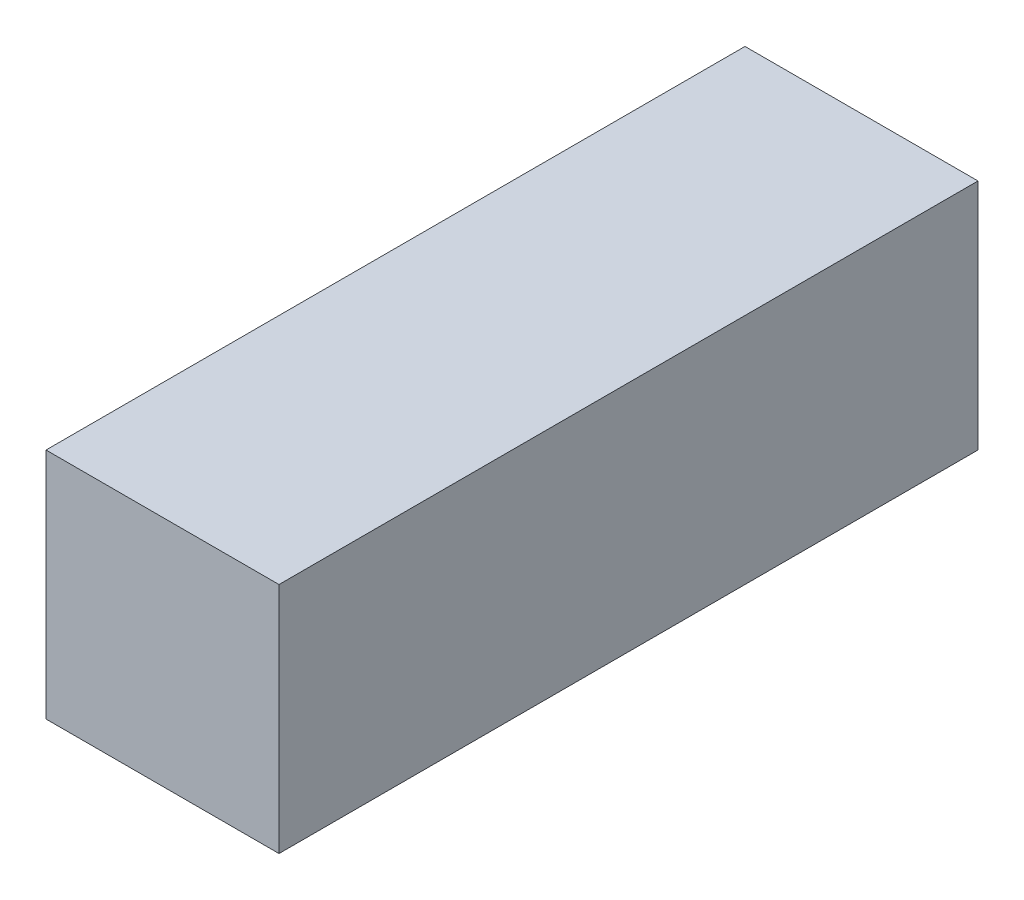
ISO-10303-21;
HEADER;
FILE_DESCRIPTION(('STEP AP214'),'2;1');
FILE_NAME('part.step','',(''),(''),'','','');
FILE_SCHEMA(('AUTOMOTIVE_DESIGN { 1 0 10303 214 1 1 1 1 }'));
ENDSEC;
DATA;
#1=APPLICATION_CONTEXT('core data for automotive mechanical design processes');
#2=APPLICATION_PROTOCOL_DEFINITION('international standard','automotive_design',2000,#1);
#3=PRODUCT_CONTEXT('',#1,'mechanical');
#4=PRODUCT('Part','Part','',(#3));
#5=PRODUCT_RELATED_PRODUCT_CATEGORY('part','',(#4));
#6=PRODUCT_DEFINITION_FORMATION('','',#4);
#7=PRODUCT_DEFINITION_CONTEXT('part definition',#1,'design');
#8=PRODUCT_DEFINITION('design','',#6,#7);
#9=PRODUCT_DEFINITION_SHAPE('','',#8);
#10=(LENGTH_UNIT() NAMED_UNIT(*) SI_UNIT(.MILLI.,.METRE.));
#11=(NAMED_UNIT(*) PLANE_ANGLE_UNIT() SI_UNIT($,.RADIAN.));
#12=(NAMED_UNIT(*) SI_UNIT($,.STERADIAN.) SOLID_ANGLE_UNIT());
#13=UNCERTAINTY_MEASURE_WITH_UNIT(LENGTH_MEASURE(1.E-05),#10,'distance_accuracy_value','');
#14=(GEOMETRIC_REPRESENTATION_CONTEXT(3) GLOBAL_UNCERTAINTY_ASSIGNED_CONTEXT((#13)) GLOBAL_UNIT_ASSIGNED_CONTEXT((#10,
#11,#12)) REPRESENTATION_CONTEXT('',''));
#15=CARTESIAN_POINT('',(0.,0.,0.));
#16=DIRECTION('',(0.,0.,1.));
#17=DIRECTION('',(1.,0.,0.));
#18=AXIS2_PLACEMENT_3D('',#15,#16,#17);
#19=CARTESIAN_POINT('',(0.,101.6,0.));
#20=DIRECTION('',(1.,0.,0.));
#21=DIRECTION('',(0.,0.,-1.));
#22=AXIS2_PLACEMENT_3D('',#19,#20,#21);
#23=PLANE('',#22);
#24=DIRECTION('',(0.,0.,1.));
#25=VECTOR('',#24,1.);
#26=CARTESIAN_POINT('',(0.,0.,0.));
#27=LINE('',#26,#25);
#28=CARTESIAN_POINT('',(0.,0.,-304.8));
#29=VERTEX_POINT('',#28);
#30=CARTESIAN_POINT('',(0.,0.,0.));
#31=VERTEX_POINT('',#30);
#32=EDGE_CURVE('E107',#29,#31,#27,.T.);
#33=ORIENTED_EDGE('',*,*,#32,.T.);
#34=DIRECTION('',(0.,-1.,0.));
#35=VECTOR('',#34,1.);
#36=CARTESIAN_POINT('',(0.,101.6,0.));
#37=LINE('',#36,#35);
#38=CARTESIAN_POINT('',(0.,101.6,0.));
#39=VERTEX_POINT('',#38);
#40=EDGE_CURVE('E11',#39,#31,#37,.T.);
#41=ORIENTED_EDGE('',*,*,#40,.F.);
#42=DIRECTION('',(0.,0.,1.));
#43=VECTOR('',#42,1.);
#44=CARTESIAN_POINT('',(0.,101.6,0.));
#45=LINE('',#44,#43);
#46=CARTESIAN_POINT('',(0.,101.6,-304.8));
#47=VERTEX_POINT('',#46);
#48=EDGE_CURVE('E91',#47,#39,#45,.T.);
#49=ORIENTED_EDGE('',*,*,#48,.F.);
#50=DIRECTION('',(0.,-1.,0.));
#51=VECTOR('',#50,1.);
#52=CARTESIAN_POINT('',(0.,101.6,-304.8));
#53=LINE('',#52,#51);
#54=EDGE_CURVE('E103',#47,#29,#53,.T.);
#55=ORIENTED_EDGE('',*,*,#54,.T.);
#56=EDGE_LOOP('',(#33,#41,#49,#55));
#57=FACE_BOUND('',#56,.T.);
#58=ADVANCED_FACE('F39',(#57),#23,.F.);
#59=CARTESIAN_POINT('',(0.,101.6,0.));
#60=DIRECTION('',(0.,0.,-1.));
#61=DIRECTION('',(-1.,0.,0.));
#62=AXIS2_PLACEMENT_3D('',#59,#60,#61);
#63=PLANE('',#62);
#64=DIRECTION('',(1.,0.,0.));
#65=VECTOR('',#64,1.);
#66=CARTESIAN_POINT('',(0.,0.,0.));
#67=LINE('',#66,#65);
#68=CARTESIAN_POINT('',(101.6,0.,0.));
#69=VERTEX_POINT('',#68);
#70=EDGE_CURVE('E96',#31,#69,#67,.T.);
#71=ORIENTED_EDGE('',*,*,#70,.T.);
#72=DIRECTION('',(0.,-1.,0.));
#73=VECTOR('',#72,1.);
#74=CARTESIAN_POINT('',(101.6,101.6,0.));
#75=LINE('',#74,#73);
#76=CARTESIAN_POINT('',(101.6,101.6,0.));
#77=VERTEX_POINT('',#76);
#78=EDGE_CURVE('E48',#77,#69,#75,.T.);
#79=ORIENTED_EDGE('',*,*,#78,.F.);
#80=DIRECTION('',(1.,0.,0.));
#81=VECTOR('',#80,1.);
#82=CARTESIAN_POINT('',(0.,101.6,0.));
#83=LINE('',#82,#81);
#84=EDGE_CURVE('E86',#39,#77,#83,.T.);
#85=ORIENTED_EDGE('',*,*,#84,.F.);
#86=ORIENTED_EDGE('',*,*,#40,.T.);
#87=EDGE_LOOP('',(#71,#79,#85,#86));
#88=FACE_BOUND('',#87,.T.);
#89=ADVANCED_FACE('F95',(#88),#63,.F.);
#90=CARTESIAN_POINT('',(101.6,101.6,0.));
#91=DIRECTION('',(-1.,0.,0.));
#92=DIRECTION('',(0.,0.,1.));
#93=AXIS2_PLACEMENT_3D('',#90,#91,#92);
#94=PLANE('',#93);
#95=DIRECTION('',(0.,0.,-1.));
#96=VECTOR('',#95,1.);
#97=CARTESIAN_POINT('',(101.6,0.,0.));
#98=LINE('',#97,#96);
#99=CARTESIAN_POINT('',(101.6,0.,-304.8));
#100=VERTEX_POINT('',#99);
#101=EDGE_CURVE('E73',#69,#100,#98,.T.);
#102=ORIENTED_EDGE('',*,*,#101,.T.);
#103=DIRECTION('',(0.,-1.,0.));
#104=VECTOR('',#103,1.);
#105=CARTESIAN_POINT('',(101.6,101.6,-304.8));
#106=LINE('',#105,#104);
#107=CARTESIAN_POINT('',(101.6,101.6,-304.8));
#108=VERTEX_POINT('',#107);
#109=EDGE_CURVE('E98',#108,#100,#106,.T.);
#110=ORIENTED_EDGE('',*,*,#109,.F.);
#111=DIRECTION('',(0.,0.,-1.));
#112=VECTOR('',#111,1.);
#113=CARTESIAN_POINT('',(101.6,101.6,0.));
#114=LINE('',#113,#112);
#115=EDGE_CURVE('E89',#77,#108,#114,.T.);
#116=ORIENTED_EDGE('',*,*,#115,.F.);
#117=ORIENTED_EDGE('',*,*,#78,.T.);
#118=EDGE_LOOP('',(#102,#110,#116,#117));
#119=FACE_BOUND('',#118,.T.);
#120=ADVANCED_FACE('F99',(#119),#94,.F.);
#121=CARTESIAN_POINT('',(0.,101.6,-304.8));
#122=DIRECTION('',(0.,0.,1.));
#123=DIRECTION('',(1.,0.,0.));
#124=AXIS2_PLACEMENT_3D('',#121,#122,#123);
#125=PLANE('',#124);
#126=DIRECTION('',(-1.,0.,0.));
#127=VECTOR('',#126,1.);
#128=CARTESIAN_POINT('',(0.,0.,-304.8));
#129=LINE('',#128,#127);
#130=EDGE_CURVE('E79',#100,#29,#129,.T.);
#131=ORIENTED_EDGE('',*,*,#130,.T.);
#132=ORIENTED_EDGE('',*,*,#54,.F.);
#133=DIRECTION('',(-1.,0.,0.));
#134=VECTOR('',#133,1.);
#135=CARTESIAN_POINT('',(0.,101.6,-304.8));
#136=LINE('',#135,#134);
#137=EDGE_CURVE('E56',#108,#47,#136,.T.);
#138=ORIENTED_EDGE('',*,*,#137,.F.);
#139=ORIENTED_EDGE('',*,*,#109,.T.);
#140=EDGE_LOOP('',(#131,#132,#138,#139));
#141=FACE_BOUND('',#140,.T.);
#142=ADVANCED_FACE('F120',(#141),#125,.F.);
#143=CARTESIAN_POINT('',(0.,101.6,0.));
#144=DIRECTION('',(0.,-1.,0.));
#145=DIRECTION('',(0.,0.,-1.));
#146=AXIS2_PLACEMENT_3D('',#143,#144,#145);
#147=PLANE('',#146);
#148=ORIENTED_EDGE('',*,*,#48,.T.);
#149=ORIENTED_EDGE('',*,*,#84,.T.);
#150=ORIENTED_EDGE('',*,*,#115,.T.);
#151=ORIENTED_EDGE('',*,*,#137,.T.);
#152=EDGE_LOOP('',(#148,#149,#150,#151));
#153=FACE_BOUND('',#152,.T.);
#154=ADVANCED_FACE('F87',(#153),#147,.F.);
#155=CARTESIAN_POINT('',(0.,0.,0.));
#156=DIRECTION('',(0.,-1.,0.));
#157=DIRECTION('',(0.,0.,-1.));
#158=AXIS2_PLACEMENT_3D('',#155,#156,#157);
#159=PLANE('',#158);
#160=ORIENTED_EDGE('',*,*,#32,.F.);
#161=ORIENTED_EDGE('',*,*,#130,.F.);
#162=ORIENTED_EDGE('',*,*,#101,.F.);
#163=ORIENTED_EDGE('',*,*,#70,.F.);
#164=EDGE_LOOP('',(#160,#161,#162,#163));
#165=FACE_BOUND('',#164,.T.);
#166=ADVANCED_FACE('F123',(#165),#159,.T.);
#167=CLOSED_SHELL('',(#58,#89,#120,#142,#154,#166));
#168=MANIFOLD_SOLID_BREP('B2',#167);
#169=ADVANCED_BREP_SHAPE_REPRESENTATION('',(#18,#168),#14);
#170=SHAPE_DEFINITION_REPRESENTATION(#9,#169);
ENDSEC;
END-ISO-10303-21;
